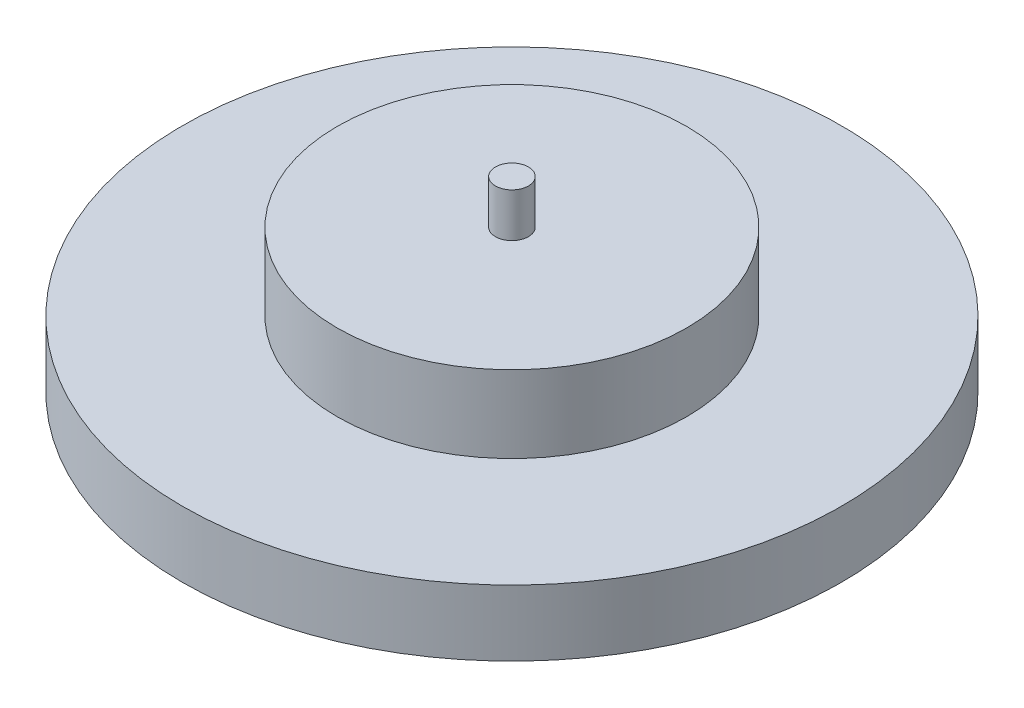
ISO-10303-21;
HEADER;
FILE_DESCRIPTION(('STEP AP214'),'2;1');
FILE_NAME('part.step','',(''),(''),'','','');
FILE_SCHEMA(('AUTOMOTIVE_DESIGN { 1 0 10303 214 1 1 1 1 }'));
ENDSEC;
DATA;
#1=APPLICATION_CONTEXT('core data for automotive mechanical design processes');
#2=APPLICATION_PROTOCOL_DEFINITION('international standard','automotive_design',2000,#1);
#3=PRODUCT_CONTEXT('',#1,'mechanical');
#4=PRODUCT('Part','Part','',(#3));
#5=PRODUCT_RELATED_PRODUCT_CATEGORY('part','',(#4));
#6=PRODUCT_DEFINITION_FORMATION('','',#4);
#7=PRODUCT_DEFINITION_CONTEXT('part definition',#1,'design');
#8=PRODUCT_DEFINITION('design','',#6,#7);
#9=PRODUCT_DEFINITION_SHAPE('','',#8);
#10=(LENGTH_UNIT() NAMED_UNIT(*) SI_UNIT(.MILLI.,.METRE.));
#11=(NAMED_UNIT(*) PLANE_ANGLE_UNIT() SI_UNIT($,.RADIAN.));
#12=(NAMED_UNIT(*) SI_UNIT($,.STERADIAN.) SOLID_ANGLE_UNIT());
#13=UNCERTAINTY_MEASURE_WITH_UNIT(LENGTH_MEASURE(1.E-05),#10,'distance_accuracy_value','');
#14=(GEOMETRIC_REPRESENTATION_CONTEXT(3) GLOBAL_UNCERTAINTY_ASSIGNED_CONTEXT((#13)) GLOBAL_UNIT_ASSIGNED_CONTEXT((#10,
#11,#12)) REPRESENTATION_CONTEXT('',''));
#15=CARTESIAN_POINT('',(0.,0.,0.));
#16=DIRECTION('',(0.,0.,1.));
#17=DIRECTION('',(1.,0.,0.));
#18=AXIS2_PLACEMENT_3D('',#15,#16,#17);
#19=CARTESIAN_POINT('',(0.,3.,0.));
#20=DIRECTION('',(0.,-1.,0.));
#21=DIRECTION('',(0.,0.,-1.));
#22=AXIS2_PLACEMENT_3D('',#19,#20,#21);
#23=CYLINDRICAL_SURFACE('',#22,15.);
#24=CARTESIAN_POINT('',(0.,3.,0.));
#25=DIRECTION('',(0.,1.,0.));
#26=DIRECTION('',(0.,0.,1.));
#27=AXIS2_PLACEMENT_3D('',#24,#25,#26);
#28=CIRCLE('',#27,15.);
#29=CARTESIAN_POINT('',(0.,3.,15.));
#30=VERTEX_POINT('',#29);
#31=EDGE_CURVE('E46',#30,#30,#28,.T.);
#32=ORIENTED_EDGE('',*,*,#31,.F.);
#33=EDGE_LOOP('',(#32));
#34=FACE_BOUND('',#33,.T.);
#35=CARTESIAN_POINT('',(0.,0.,0.));
#36=DIRECTION('',(0.,1.,0.));
#37=DIRECTION('',(0.,0.,1.));
#38=AXIS2_PLACEMENT_3D('',#35,#36,#37);
#39=CIRCLE('',#38,15.);
#40=CARTESIAN_POINT('',(0.,0.,15.));
#41=VERTEX_POINT('',#40);
#42=EDGE_CURVE('E42',#41,#41,#39,.T.);
#43=ORIENTED_EDGE('',*,*,#42,.T.);
#44=EDGE_LOOP('',(#43));
#45=FACE_BOUND('',#44,.T.);
#46=ADVANCED_FACE('F39',(#34,#45),#23,.T.);
#47=CARTESIAN_POINT('',(0.,3.,0.));
#48=DIRECTION('',(0.,1.,0.));
#49=DIRECTION('',(0.,0.,1.));
#50=AXIS2_PLACEMENT_3D('',#47,#48,#49);
#51=PLANE('',#50);
#52=CARTESIAN_POINT('',(0.,3.,0.));
#53=DIRECTION('',(0.,1.,0.));
#54=DIRECTION('',(0.,0.,1.));
#55=AXIS2_PLACEMENT_3D('',#52,#53,#54);
#56=CIRCLE('',#55,7.95);
#57=CARTESIAN_POINT('',(0.,3.,7.95));
#58=VERTEX_POINT('',#57);
#59=EDGE_CURVE('E10',#58,#58,#56,.T.);
#60=ORIENTED_EDGE('',*,*,#59,.F.);
#61=EDGE_LOOP('',(#60));
#62=FACE_BOUND('',#61,.T.);
#63=ORIENTED_EDGE('',*,*,#31,.T.);
#64=EDGE_LOOP('',(#63));
#65=FACE_BOUND('',#64,.T.);
#66=ADVANCED_FACE('F84',(#62,#65),#51,.T.);
#67=CARTESIAN_POINT('',(0.,0.,0.));
#68=DIRECTION('',(0.,1.,0.));
#69=DIRECTION('',(0.,0.,1.));
#70=AXIS2_PLACEMENT_3D('',#67,#68,#69);
#71=PLANE('',#70);
#72=ORIENTED_EDGE('',*,*,#42,.F.);
#73=EDGE_LOOP('',(#72));
#74=FACE_BOUND('',#73,.T.);
#75=ADVANCED_FACE('F78',(#74),#71,.F.);
#76=CARTESIAN_POINT('',(0.,6.5,0.));
#77=DIRECTION('',(0.,-1.,0.));
#78=DIRECTION('',(0.,0.,-1.));
#79=AXIS2_PLACEMENT_3D('',#76,#77,#78);
#80=CYLINDRICAL_SURFACE('',#79,7.95);
#81=CARTESIAN_POINT('',(0.,6.5,0.));
#82=DIRECTION('',(0.,1.,0.));
#83=DIRECTION('',(0.,0.,1.));
#84=AXIS2_PLACEMENT_3D('',#81,#82,#83);
#85=CIRCLE('',#84,7.95);
#86=CARTESIAN_POINT('',(0.,6.5,7.95));
#87=VERTEX_POINT('',#86);
#88=EDGE_CURVE('E52',#87,#87,#85,.T.);
#89=ORIENTED_EDGE('',*,*,#88,.F.);
#90=EDGE_LOOP('',(#89));
#91=FACE_BOUND('',#90,.T.);
#92=ORIENTED_EDGE('',*,*,#59,.T.);
#93=EDGE_LOOP('',(#92));
#94=FACE_BOUND('',#93,.T.);
#95=ADVANCED_FACE('F73',(#91,#94),#80,.T.);
#96=CARTESIAN_POINT('',(0.,6.5,0.));
#97=DIRECTION('',(0.,1.,0.));
#98=DIRECTION('',(0.,0.,1.));
#99=AXIS2_PLACEMENT_3D('',#96,#97,#98);
#100=PLANE('',#99);
#101=CARTESIAN_POINT('',(0.,6.5,0.));
#102=DIRECTION('',(0.,1.,0.));
#103=DIRECTION('',(0.,0.,1.));
#104=AXIS2_PLACEMENT_3D('',#101,#102,#103);
#105=CIRCLE('',#104,0.75);
#106=CARTESIAN_POINT('',(0.,6.5,0.75));
#107=VERTEX_POINT('',#106);
#108=EDGE_CURVE('E56',#107,#107,#105,.T.);
#109=ORIENTED_EDGE('',*,*,#108,.F.);
#110=EDGE_LOOP('',(#109));
#111=FACE_BOUND('',#110,.T.);
#112=ORIENTED_EDGE('',*,*,#88,.T.);
#113=EDGE_LOOP('',(#112));
#114=FACE_BOUND('',#113,.T.);
#115=ADVANCED_FACE('F67',(#111,#114),#100,.T.);
#116=CARTESIAN_POINT('',(0.,8.5,0.));
#117=DIRECTION('',(0.,-1.,0.));
#118=DIRECTION('',(0.,0.,-1.));
#119=AXIS2_PLACEMENT_3D('',#116,#117,#118);
#120=CYLINDRICAL_SURFACE('',#119,0.75);
#121=CARTESIAN_POINT('',(0.,8.5,0.));
#122=DIRECTION('',(0.,1.,0.));
#123=DIRECTION('',(0.,0.,1.));
#124=AXIS2_PLACEMENT_3D('',#121,#122,#123);
#125=CIRCLE('',#124,0.75);
#126=CARTESIAN_POINT('',(0.,8.5,0.75));
#127=VERTEX_POINT('',#126);
#128=EDGE_CURVE('E55',#127,#127,#125,.T.);
#129=ORIENTED_EDGE('',*,*,#128,.F.);
#130=EDGE_LOOP('',(#129));
#131=FACE_BOUND('',#130,.T.);
#132=ORIENTED_EDGE('',*,*,#108,.T.);
#133=EDGE_LOOP('',(#132));
#134=FACE_BOUND('',#133,.T.);
#135=ADVANCED_FACE('F64',(#131,#134),#120,.T.);
#136=CARTESIAN_POINT('',(0.,8.5,0.));
#137=DIRECTION('',(0.,1.,0.));
#138=DIRECTION('',(0.,0.,1.));
#139=AXIS2_PLACEMENT_3D('',#136,#137,#138);
#140=PLANE('',#139);
#141=ORIENTED_EDGE('',*,*,#128,.T.);
#142=EDGE_LOOP('',(#141));
#143=FACE_BOUND('',#142,.T.);
#144=ADVANCED_FACE('F62',(#143),#140,.T.);
#145=CLOSED_SHELL('',(#46,#66,#75,#95,#115,#135,#144));
#146=MANIFOLD_SOLID_BREP('B2',#145);
#147=ADVANCED_BREP_SHAPE_REPRESENTATION('',(#18,#146),#14);
#148=SHAPE_DEFINITION_REPRESENTATION(#9,#147);
ENDSEC;
END-ISO-10303-21;
